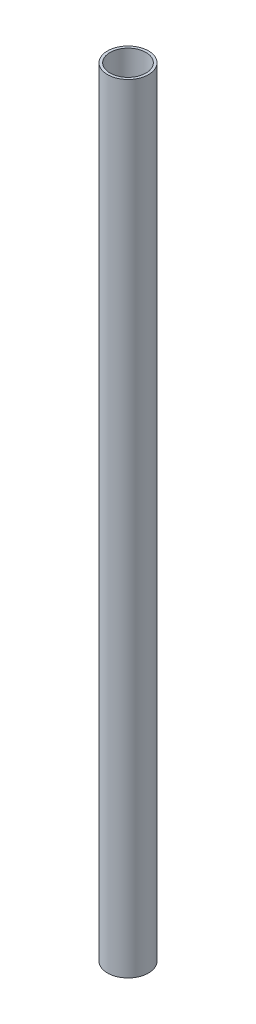
ISO-10303-21;
HEADER;
FILE_DESCRIPTION(('STEP AP214'),'2;1');
FILE_NAME('part.step','',(''),(''),'','','');
FILE_SCHEMA(('AUTOMOTIVE_DESIGN { 1 0 10303 214 1 1 1 1 }'));
ENDSEC;
DATA;
#1=APPLICATION_CONTEXT('core data for automotive mechanical design processes');
#2=APPLICATION_PROTOCOL_DEFINITION('international standard','automotive_design',2000,#1);
#3=PRODUCT_CONTEXT('',#1,'mechanical');
#4=PRODUCT('Part','Part','',(#3));
#5=PRODUCT_RELATED_PRODUCT_CATEGORY('part','',(#4));
#6=PRODUCT_DEFINITION_FORMATION('','',#4);
#7=PRODUCT_DEFINITION_CONTEXT('part definition',#1,'design');
#8=PRODUCT_DEFINITION('design','',#6,#7);
#9=PRODUCT_DEFINITION_SHAPE('','',#8);
#10=(LENGTH_UNIT() NAMED_UNIT(*) SI_UNIT(.MILLI.,.METRE.));
#11=(NAMED_UNIT(*) PLANE_ANGLE_UNIT() SI_UNIT($,.RADIAN.));
#12=(NAMED_UNIT(*) SI_UNIT($,.STERADIAN.) SOLID_ANGLE_UNIT());
#13=UNCERTAINTY_MEASURE_WITH_UNIT(LENGTH_MEASURE(1.E-05),#10,'distance_accuracy_value','');
#14=(GEOMETRIC_REPRESENTATION_CONTEXT(3) GLOBAL_UNCERTAINTY_ASSIGNED_CONTEXT((#13)) GLOBAL_UNIT_ASSIGNED_CONTEXT((#10,
#11,#12)) REPRESENTATION_CONTEXT('',''));
#15=CARTESIAN_POINT('',(0.,0.,0.));
#16=DIRECTION('',(0.,0.,1.));
#17=DIRECTION('',(1.,0.,0.));
#18=AXIS2_PLACEMENT_3D('',#15,#16,#17);
#19=CARTESIAN_POINT('',(0.,-361.,0.));
#20=DIRECTION('',(0.,-1.,0.));
#21=DIRECTION('',(0.,0.,-1.));
#22=AXIS2_PLACEMENT_3D('',#19,#20,#21);
#23=PLANE('',#22);
#24=CARTESIAN_POINT('',(0.,-361.,0.));
#25=DIRECTION('',(0.,-1.,0.));
#26=DIRECTION('',(0.,0.,-1.));
#27=AXIS2_PLACEMENT_3D('',#24,#25,#26);
#28=CIRCLE('',#27,9.525);
#29=CARTESIAN_POINT('',(0.,-361.,-9.525));
#30=VERTEX_POINT('',#29);
#31=EDGE_CURVE('E10',#30,#30,#28,.T.);
#32=ORIENTED_EDGE('',*,*,#31,.T.);
#33=EDGE_LOOP('',(#32));
#34=FACE_BOUND('',#33,.T.);
#35=CARTESIAN_POINT('',(0.,-361.,0.));
#36=DIRECTION('',(0.,-1.,0.));
#37=DIRECTION('',(0.,0.,-1.));
#38=AXIS2_PLACEMENT_3D('',#35,#36,#37);
#39=CIRCLE('',#38,8.325);
#40=CARTESIAN_POINT('',(0.,-361.,-8.325));
#41=VERTEX_POINT('',#40);
#42=EDGE_CURVE('E51',#41,#41,#39,.T.);
#43=ORIENTED_EDGE('',*,*,#42,.F.);
#44=EDGE_LOOP('',(#43));
#45=FACE_BOUND('',#44,.T.);
#46=ADVANCED_FACE('F40',(#34,#45),#23,.T.);
#47=CARTESIAN_POINT('',(0.,0.,0.));
#48=DIRECTION('',(0.,-1.,0.));
#49=DIRECTION('',(0.,0.,-1.));
#50=AXIS2_PLACEMENT_3D('',#47,#48,#49);
#51=PLANE('',#50);
#52=CARTESIAN_POINT('',(0.,0.,0.));
#53=DIRECTION('',(0.,-1.,0.));
#54=DIRECTION('',(0.,0.,-1.));
#55=AXIS2_PLACEMENT_3D('',#52,#53,#54);
#56=CIRCLE('',#55,9.525);
#57=CARTESIAN_POINT('',(0.,0.,-9.525));
#58=VERTEX_POINT('',#57);
#59=EDGE_CURVE('E44',#58,#58,#56,.T.);
#60=ORIENTED_EDGE('',*,*,#59,.F.);
#61=EDGE_LOOP('',(#60));
#62=FACE_BOUND('',#61,.T.);
#63=CARTESIAN_POINT('',(0.,0.,0.));
#64=DIRECTION('',(0.,-1.,0.));
#65=DIRECTION('',(0.,0.,-1.));
#66=AXIS2_PLACEMENT_3D('',#63,#64,#65);
#67=CIRCLE('',#66,8.325);
#68=CARTESIAN_POINT('',(0.,0.,-8.325));
#69=VERTEX_POINT('',#68);
#70=EDGE_CURVE('E53',#69,#69,#67,.T.);
#71=ORIENTED_EDGE('',*,*,#70,.T.);
#72=EDGE_LOOP('',(#71));
#73=FACE_BOUND('',#72,.T.);
#74=ADVANCED_FACE('F63',(#62,#73),#51,.F.);
#75=CARTESIAN_POINT('',(0.,-361.,0.));
#76=DIRECTION('',(0.,1.,0.));
#77=DIRECTION('',(0.,0.,1.));
#78=AXIS2_PLACEMENT_3D('',#75,#76,#77);
#79=CYLINDRICAL_SURFACE('',#78,9.525);
#80=ORIENTED_EDGE('',*,*,#31,.F.);
#81=EDGE_LOOP('',(#80));
#82=FACE_BOUND('',#81,.T.);
#83=ORIENTED_EDGE('',*,*,#59,.T.);
#84=EDGE_LOOP('',(#83));
#85=FACE_BOUND('',#84,.T.);
#86=ADVANCED_FACE('F42',(#82,#85),#79,.T.);
#87=CARTESIAN_POINT('',(0.,-361.,0.));
#88=DIRECTION('',(0.,1.,0.));
#89=DIRECTION('',(0.,0.,1.));
#90=AXIS2_PLACEMENT_3D('',#87,#88,#89);
#91=CYLINDRICAL_SURFACE('',#90,8.325);
#92=ORIENTED_EDGE('',*,*,#42,.T.);
#93=EDGE_LOOP('',(#92));
#94=FACE_BOUND('',#93,.T.);
#95=ORIENTED_EDGE('',*,*,#70,.F.);
#96=EDGE_LOOP('',(#95));
#97=FACE_BOUND('',#96,.T.);
#98=ADVANCED_FACE('F59',(#94,#97),#91,.F.);
#99=CLOSED_SHELL('',(#46,#74,#86,#98));
#100=MANIFOLD_SOLID_BREP('B2',#99);
#101=ADVANCED_BREP_SHAPE_REPRESENTATION('',(#18,#100),#14);
#102=SHAPE_DEFINITION_REPRESENTATION(#9,#101);
ENDSEC;
END-ISO-10303-21;
